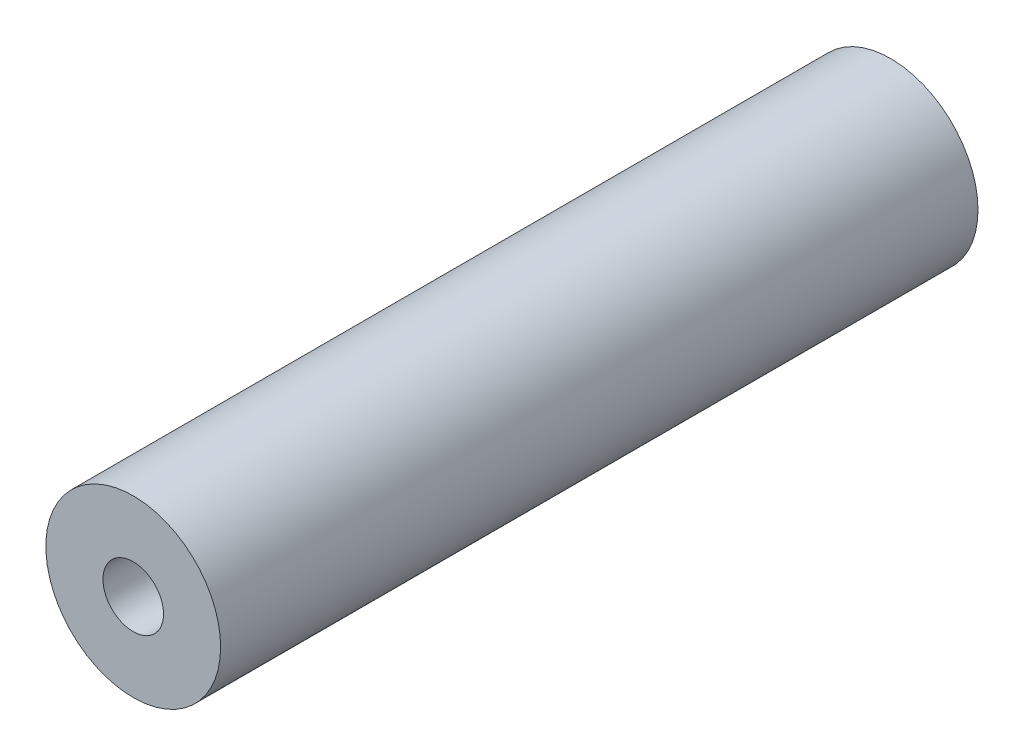
ISO-10303-21;
HEADER;
FILE_DESCRIPTION(('STEP AP214'),'2;1');
FILE_NAME('part.step','',(''),(''),'','','');
FILE_SCHEMA(('AUTOMOTIVE_DESIGN { 1 0 10303 214 1 1 1 1 }'));
ENDSEC;
DATA;
#1=APPLICATION_CONTEXT('core data for automotive mechanical design processes');
#2=APPLICATION_PROTOCOL_DEFINITION('international standard','automotive_design',2000,#1);
#3=PRODUCT_CONTEXT('',#1,'mechanical');
#4=PRODUCT('Part','Part','',(#3));
#5=PRODUCT_RELATED_PRODUCT_CATEGORY('part','',(#4));
#6=PRODUCT_DEFINITION_FORMATION('','',#4);
#7=PRODUCT_DEFINITION_CONTEXT('part definition',#1,'design');
#8=PRODUCT_DEFINITION('design','',#6,#7);
#9=PRODUCT_DEFINITION_SHAPE('','',#8);
#10=(LENGTH_UNIT() NAMED_UNIT(*) SI_UNIT(.MILLI.,.METRE.));
#11=(NAMED_UNIT(*) PLANE_ANGLE_UNIT() SI_UNIT($,.RADIAN.));
#12=(NAMED_UNIT(*) SI_UNIT($,.STERADIAN.) SOLID_ANGLE_UNIT());
#13=UNCERTAINTY_MEASURE_WITH_UNIT(LENGTH_MEASURE(1.E-05),#10,'distance_accuracy_value','');
#14=(GEOMETRIC_REPRESENTATION_CONTEXT(3) GLOBAL_UNCERTAINTY_ASSIGNED_CONTEXT((#13)) GLOBAL_UNIT_ASSIGNED_CONTEXT((#10,
#11,#12)) REPRESENTATION_CONTEXT('',''));
#15=CARTESIAN_POINT('',(0.,0.,0.));
#16=DIRECTION('',(0.,0.,1.));
#17=DIRECTION('',(1.,0.,0.));
#18=AXIS2_PLACEMENT_3D('',#15,#16,#17);
#19=CARTESIAN_POINT('',(0.,0.,41.275));
#20=DIRECTION('',(0.,0.,-1.));
#21=DIRECTION('',(-1.,0.,0.));
#22=AXIS2_PLACEMENT_3D('',#19,#20,#21);
#23=CYLINDRICAL_SURFACE('',#22,4.7625);
#24=CARTESIAN_POINT('',(0.,0.,41.275));
#25=DIRECTION('',(0.,0.,1.));
#26=DIRECTION('',(1.,0.,0.));
#27=AXIS2_PLACEMENT_3D('',#24,#25,#26);
#28=CIRCLE('',#27,4.7625);
#29=CARTESIAN_POINT('',(4.7625,0.,41.275));
#30=VERTEX_POINT('',#29);
#31=EDGE_CURVE('E11',#30,#30,#28,.T.);
#32=ORIENTED_EDGE('',*,*,#31,.F.);
#33=EDGE_LOOP('',(#32));
#34=FACE_BOUND('',#33,.T.);
#35=CARTESIAN_POINT('',(0.,0.,0.));
#36=DIRECTION('',(0.,0.,1.));
#37=DIRECTION('',(1.,0.,0.));
#38=AXIS2_PLACEMENT_3D('',#35,#36,#37);
#39=CIRCLE('',#38,4.7625);
#40=CARTESIAN_POINT('',(4.7625,0.,0.));
#41=VERTEX_POINT('',#40);
#42=EDGE_CURVE('E40',#41,#41,#39,.T.);
#43=ORIENTED_EDGE('',*,*,#42,.T.);
#44=EDGE_LOOP('',(#43));
#45=FACE_BOUND('',#44,.T.);
#46=ADVANCED_FACE('F37',(#34,#45),#23,.T.);
#47=CARTESIAN_POINT('',(0.,0.,41.275));
#48=DIRECTION('',(0.,0.,1.));
#49=DIRECTION('',(1.,0.,0.));
#50=AXIS2_PLACEMENT_3D('',#47,#48,#49);
#51=PLANE('',#50);
#52=CARTESIAN_POINT('',(0.,0.,41.275));
#53=DIRECTION('',(0.,0.,1.));
#54=DIRECTION('',(1.,0.,0.));
#55=AXIS2_PLACEMENT_3D('',#52,#53,#54);
#56=CIRCLE('',#55,1.64999999999999);
#57=CARTESIAN_POINT('',(1.64999999999999,0.,41.275));
#58=VERTEX_POINT('',#57);
#59=EDGE_CURVE('E60',#58,#58,#56,.T.);
#60=ORIENTED_EDGE('',*,*,#59,.F.);
#61=EDGE_LOOP('',(#60));
#62=FACE_BOUND('',#61,.T.);
#63=ORIENTED_EDGE('',*,*,#31,.T.);
#64=EDGE_LOOP('',(#63));
#65=FACE_BOUND('',#64,.T.);
#66=ADVANCED_FACE('F79',(#62,#65),#51,.T.);
#67=CARTESIAN_POINT('',(0.,0.,0.));
#68=DIRECTION('',(0.,0.,1.));
#69=DIRECTION('',(1.,0.,0.));
#70=AXIS2_PLACEMENT_3D('',#67,#68,#69);
#71=PLANE('',#70);
#72=CARTESIAN_POINT('',(0.,0.,0.));
#73=DIRECTION('',(0.,0.,-1.));
#74=DIRECTION('',(-1.,0.,0.));
#75=AXIS2_PLACEMENT_3D('',#72,#73,#74);
#76=CIRCLE('',#75,1.7272);
#77=CARTESIAN_POINT('',(-1.7272,0.,0.));
#78=VERTEX_POINT('',#77);
#79=EDGE_CURVE('E61',#78,#78,#76,.T.);
#80=ORIENTED_EDGE('',*,*,#79,.F.);
#81=EDGE_LOOP('',(#80));
#82=FACE_BOUND('',#81,.T.);
#83=ORIENTED_EDGE('',*,*,#42,.F.);
#84=EDGE_LOOP('',(#83));
#85=FACE_BOUND('',#84,.T.);
#86=ADVANCED_FACE('F76',(#82,#85),#71,.F.);
#87=CARTESIAN_POINT('',(0.,0.,28.575));
#88=DIRECTION('',(0.,0.,1.));
#89=DIRECTION('',(1.,0.,0.));
#90=AXIS2_PLACEMENT_3D('',#87,#88,#89);
#91=CONICAL_SURFACE('',#90,1.65,1.02974425867665);
#92=CARTESIAN_POINT('',(0.,0.,27.5835799786045));
#93=VERTEX_POINT('',#92);
#94=VERTEX_LOOP('',#93);
#95=FACE_BOUND('',#94,.T.);
#96=CARTESIAN_POINT('',(0.,0.,28.575));
#97=DIRECTION('',(0.,0.,1.));
#98=DIRECTION('',(1.,0.,0.));
#99=AXIS2_PLACEMENT_3D('',#96,#97,#98);
#100=CIRCLE('',#99,1.65);
#101=CARTESIAN_POINT('',(1.65,0.,28.575));
#102=VERTEX_POINT('',#101);
#103=EDGE_CURVE('E64',#102,#102,#100,.T.);
#104=ORIENTED_EDGE('',*,*,#103,.T.);
#105=EDGE_LOOP('',(#104));
#106=FACE_BOUND('',#105,.T.);
#107=ADVANCED_FACE('F78',(#95,#106),#91,.F.);
#108=CARTESIAN_POINT('',(0.,0.,41.275));
#109=DIRECTION('',(0.,0.,1.));
#110=DIRECTION('',(1.,0.,0.));
#111=AXIS2_PLACEMENT_3D('',#108,#109,#110);
#112=CYLINDRICAL_SURFACE('',#111,1.64999999999999);
#113=ORIENTED_EDGE('',*,*,#103,.F.);
#114=EDGE_LOOP('',(#113));
#115=FACE_BOUND('',#114,.T.);
#116=ORIENTED_EDGE('',*,*,#59,.T.);
#117=EDGE_LOOP('',(#116));
#118=FACE_BOUND('',#117,.T.);
#119=ADVANCED_FACE('F54',(#115,#118),#112,.F.);
#120=CARTESIAN_POINT('',(0.,0.,13.208));
#121=DIRECTION('',(0.,0.,-1.));
#122=DIRECTION('',(-1.,0.,0.));
#123=AXIS2_PLACEMENT_3D('',#120,#121,#122);
#124=CONICAL_SURFACE('',#123,1.7272,1.02974425867665);
#125=CARTESIAN_POINT('',(0.,0.,14.2458064611844));
#126=VERTEX_POINT('',#125);
#127=VERTEX_LOOP('',#126);
#128=FACE_BOUND('',#127,.T.);
#129=CARTESIAN_POINT('',(0.,0.,13.208));
#130=DIRECTION('',(0.,0.,-1.));
#131=DIRECTION('',(-1.,0.,0.));
#132=AXIS2_PLACEMENT_3D('',#129,#130,#131);
#133=CIRCLE('',#132,1.7272);
#134=CARTESIAN_POINT('',(-1.7272,0.,13.208));
#135=VERTEX_POINT('',#134);
#136=EDGE_CURVE('E58',#135,#135,#133,.T.);
#137=ORIENTED_EDGE('',*,*,#136,.T.);
#138=EDGE_LOOP('',(#137));
#139=FACE_BOUND('',#138,.T.);
#140=ADVANCED_FACE('F50',(#128,#139),#124,.F.);
#141=CARTESIAN_POINT('',(0.,0.,0.));
#142=DIRECTION('',(0.,0.,-1.));
#143=DIRECTION('',(-1.,0.,0.));
#144=AXIS2_PLACEMENT_3D('',#141,#142,#143);
#145=CYLINDRICAL_SURFACE('',#144,1.7272);
#146=ORIENTED_EDGE('',*,*,#136,.F.);
#147=EDGE_LOOP('',(#146));
#148=FACE_BOUND('',#147,.T.);
#149=ORIENTED_EDGE('',*,*,#79,.T.);
#150=EDGE_LOOP('',(#149));
#151=FACE_BOUND('',#150,.T.);
#152=ADVANCED_FACE('F53',(#148,#151),#145,.F.);
#153=CLOSED_SHELL('',(#46,#66,#86,#107,#119,#140,#152));
#154=MANIFOLD_SOLID_BREP('B2',#153);
#155=ADVANCED_BREP_SHAPE_REPRESENTATION('',(#18,#154),#14);
#156=SHAPE_DEFINITION_REPRESENTATION(#9,#155);
ENDSEC;
END-ISO-10303-21;
